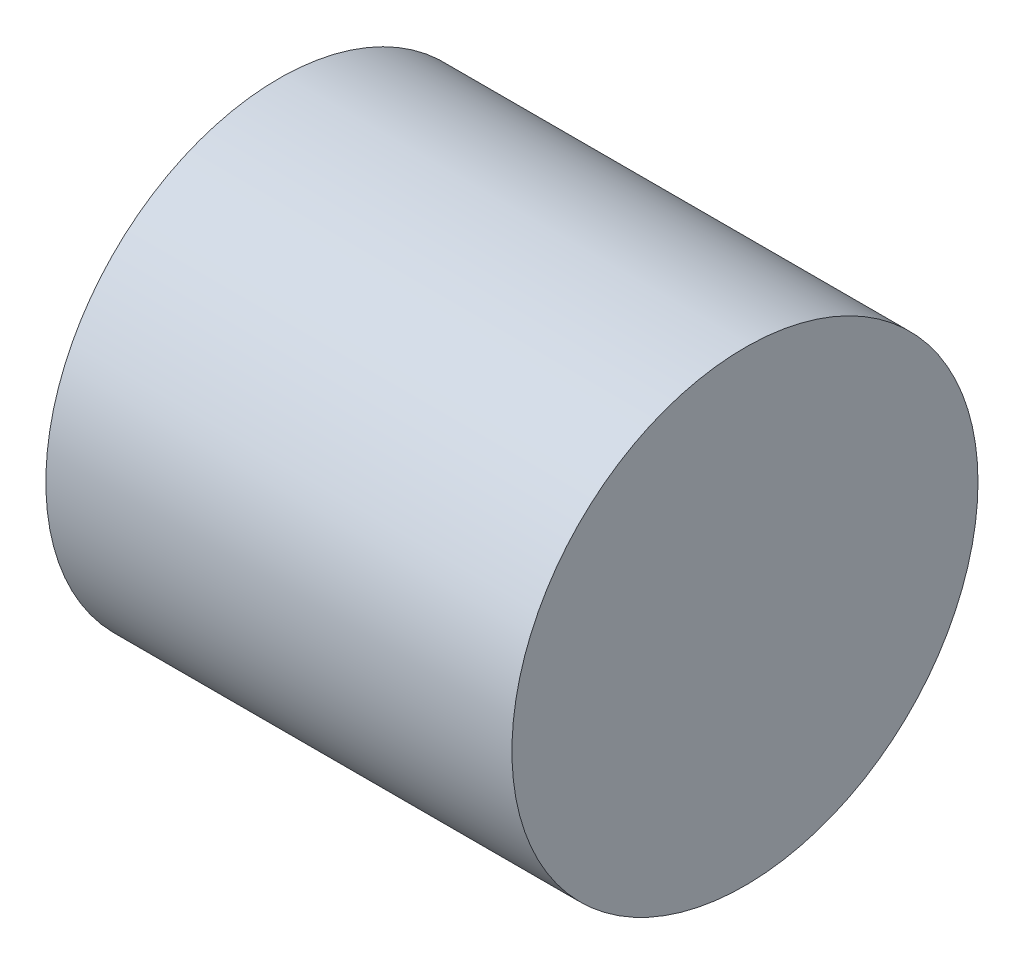
ISO-10303-21;
HEADER;
FILE_DESCRIPTION(('STEP AP214'),'2;1');
FILE_NAME('part.step','',(''),(''),'','','');
FILE_SCHEMA(('AUTOMOTIVE_DESIGN { 1 0 10303 214 1 1 1 1 }'));
ENDSEC;
DATA;
#1=APPLICATION_CONTEXT('core data for automotive mechanical design processes');
#2=APPLICATION_PROTOCOL_DEFINITION('international standard','automotive_design',2000,#1);
#3=PRODUCT_CONTEXT('',#1,'mechanical');
#4=PRODUCT('Part','Part','',(#3));
#5=PRODUCT_RELATED_PRODUCT_CATEGORY('part','',(#4));
#6=PRODUCT_DEFINITION_FORMATION('','',#4);
#7=PRODUCT_DEFINITION_CONTEXT('part definition',#1,'design');
#8=PRODUCT_DEFINITION('design','',#6,#7);
#9=PRODUCT_DEFINITION_SHAPE('','',#8);
#10=(LENGTH_UNIT() NAMED_UNIT(*) SI_UNIT(.MILLI.,.METRE.));
#11=(NAMED_UNIT(*) PLANE_ANGLE_UNIT() SI_UNIT($,.RADIAN.));
#12=(NAMED_UNIT(*) SI_UNIT($,.STERADIAN.) SOLID_ANGLE_UNIT());
#13=UNCERTAINTY_MEASURE_WITH_UNIT(LENGTH_MEASURE(1.E-05),#10,'distance_accuracy_value','');
#14=(GEOMETRIC_REPRESENTATION_CONTEXT(3) GLOBAL_UNCERTAINTY_ASSIGNED_CONTEXT((#13)) GLOBAL_UNIT_ASSIGNED_CONTEXT((#10,
#11,#12)) REPRESENTATION_CONTEXT('',''));
#15=CARTESIAN_POINT('',(0.,0.,0.));
#16=DIRECTION('',(0.,0.,1.));
#17=DIRECTION('',(1.,0.,0.));
#18=AXIS2_PLACEMENT_3D('',#15,#16,#17);
#19=CARTESIAN_POINT('',(19.05,47.4526245214975,77.094742909992));
#20=DIRECTION('',(-1.,0.,0.));
#21=DIRECTION('',(0.,0.,1.));
#22=AXIS2_PLACEMENT_3D('',#19,#20,#21);
#23=CYLINDRICAL_SURFACE('',#22,9.52500000000001);
#24=CARTESIAN_POINT('',(19.05,47.4526245214975,77.094742909992));
#25=DIRECTION('',(1.,0.,0.));
#26=DIRECTION('',(0.,0.,-1.));
#27=AXIS2_PLACEMENT_3D('',#24,#25,#26);
#28=CIRCLE('',#27,9.52500000000001);
#29=CARTESIAN_POINT('',(19.05,47.4526245214975,67.569742909992));
#30=VERTEX_POINT('',#29);
#31=EDGE_CURVE('E10',#30,#30,#28,.T.);
#32=ORIENTED_EDGE('',*,*,#31,.F.);
#33=EDGE_LOOP('',(#32));
#34=FACE_BOUND('',#33,.T.);
#35=CARTESIAN_POINT('',(0.,47.4526245214975,77.094742909992));
#36=DIRECTION('',(1.,0.,0.));
#37=DIRECTION('',(0.,0.,-1.));
#38=AXIS2_PLACEMENT_3D('',#35,#36,#37);
#39=CIRCLE('',#38,9.52500000000001);
#40=CARTESIAN_POINT('',(0.,47.4526245214975,67.569742909992));
#41=VERTEX_POINT('',#40);
#42=EDGE_CURVE('E32',#41,#41,#39,.T.);
#43=ORIENTED_EDGE('',*,*,#42,.T.);
#44=EDGE_LOOP('',(#43));
#45=FACE_BOUND('',#44,.T.);
#46=ADVANCED_FACE('F29',(#34,#45),#23,.T.);
#47=CARTESIAN_POINT('',(19.05,47.4526245214975,77.094742909992));
#48=DIRECTION('',(1.,0.,0.));
#49=DIRECTION('',(0.,0.,-1.));
#50=AXIS2_PLACEMENT_3D('',#47,#48,#49);
#51=PLANE('',#50);
#52=ORIENTED_EDGE('',*,*,#31,.T.);
#53=EDGE_LOOP('',(#52));
#54=FACE_BOUND('',#53,.T.);
#55=ADVANCED_FACE('F44',(#54),#51,.T.);
#56=CARTESIAN_POINT('',(0.,47.4526245214975,77.094742909992));
#57=DIRECTION('',(1.,0.,0.));
#58=DIRECTION('',(0.,0.,-1.));
#59=AXIS2_PLACEMENT_3D('',#56,#57,#58);
#60=PLANE('',#59);
#61=ORIENTED_EDGE('',*,*,#42,.F.);
#62=EDGE_LOOP('',(#61));
#63=FACE_BOUND('',#62,.T.);
#64=ADVANCED_FACE('F42',(#63),#60,.F.);
#65=CLOSED_SHELL('',(#46,#55,#64));
#66=MANIFOLD_SOLID_BREP('B2',#65);
#67=ADVANCED_BREP_SHAPE_REPRESENTATION('',(#18,#66),#14);
#68=SHAPE_DEFINITION_REPRESENTATION(#9,#67);
ENDSEC;
END-ISO-10303-21;
